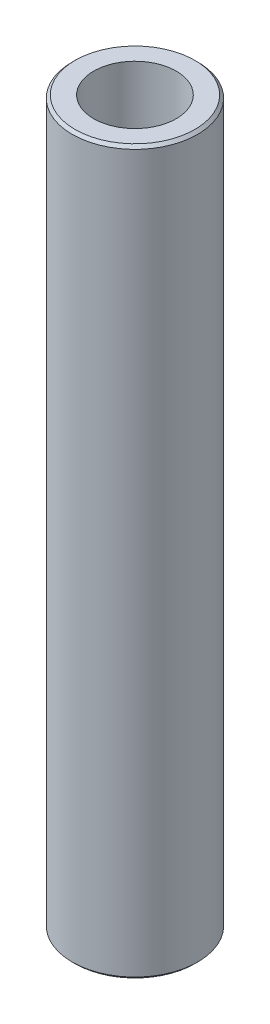
ISO-10303-21;
HEADER;
FILE_DESCRIPTION(('STEP AP214'),'2;1');
FILE_NAME('part.step','',(''),(''),'','','');
FILE_SCHEMA(('AUTOMOTIVE_DESIGN { 1 0 10303 214 1 1 1 1 }'));
ENDSEC;
DATA;
#1=APPLICATION_CONTEXT('core data for automotive mechanical design processes');
#2=APPLICATION_PROTOCOL_DEFINITION('international standard','automotive_design',2000,#1);
#3=PRODUCT_CONTEXT('',#1,'mechanical');
#4=PRODUCT('Part','Part','',(#3));
#5=PRODUCT_RELATED_PRODUCT_CATEGORY('part','',(#4));
#6=PRODUCT_DEFINITION_FORMATION('','',#4);
#7=PRODUCT_DEFINITION_CONTEXT('part definition',#1,'design');
#8=PRODUCT_DEFINITION('design','',#6,#7);
#9=PRODUCT_DEFINITION_SHAPE('','',#8);
#10=(LENGTH_UNIT() NAMED_UNIT(*) SI_UNIT(.MILLI.,.METRE.));
#11=(NAMED_UNIT(*) PLANE_ANGLE_UNIT() SI_UNIT($,.RADIAN.));
#12=(NAMED_UNIT(*) SI_UNIT($,.STERADIAN.) SOLID_ANGLE_UNIT());
#13=UNCERTAINTY_MEASURE_WITH_UNIT(LENGTH_MEASURE(1.E-05),#10,'distance_accuracy_value','');
#14=(GEOMETRIC_REPRESENTATION_CONTEXT(3) GLOBAL_UNCERTAINTY_ASSIGNED_CONTEXT((#13)) GLOBAL_UNIT_ASSIGNED_CONTEXT((#10,
#11,#12)) REPRESENTATION_CONTEXT('',''));
#15=CARTESIAN_POINT('',(0.,0.,0.));
#16=DIRECTION('',(0.,0.,1.));
#17=DIRECTION('',(1.,0.,0.));
#18=AXIS2_PLACEMENT_3D('',#15,#16,#17);
#19=CARTESIAN_POINT('',(0.,172.743536967441,0.));
#20=DIRECTION('',(0.,-1.,0.));
#21=DIRECTION('',(0.,0.,-1.));
#22=AXIS2_PLACEMENT_3D('',#19,#20,#21);
#23=CYLINDRICAL_SURFACE('',#22,15.);
#24=CARTESIAN_POINT('',(0.,172.067154813635,0.));
#25=DIRECTION('',(0.,1.,0.));
#26=DIRECTION('',(0.,0.,1.));
#27=AXIS2_PLACEMENT_3D('',#24,#25,#26);
#28=CIRCLE('',#27,15.);
#29=CARTESIAN_POINT('',(0.,172.067154813635,15.));
#30=VERTEX_POINT('',#29);
#31=EDGE_CURVE('E50',#30,#30,#28,.F.);
#32=ORIENTED_EDGE('',*,*,#31,.T.);
#33=EDGE_LOOP('',(#32));
#34=FACE_BOUND('',#33,.T.);
#35=CARTESIAN_POINT('',(0.,0.676382153805832,0.));
#36=DIRECTION('',(0.,1.,0.));
#37=DIRECTION('',(0.,0.,1.));
#38=AXIS2_PLACEMENT_3D('',#35,#36,#37);
#39=CIRCLE('',#38,15.);
#40=CARTESIAN_POINT('',(0.,0.676382153805832,15.));
#41=VERTEX_POINT('',#40);
#42=EDGE_CURVE('E51',#41,#41,#39,.T.);
#43=ORIENTED_EDGE('',*,*,#42,.T.);
#44=EDGE_LOOP('',(#43));
#45=FACE_BOUND('',#44,.T.);
#46=ADVANCED_FACE('F39',(#34,#45),#23,.T.);
#47=CARTESIAN_POINT('',(0.,172.743536967441,0.));
#48=DIRECTION('',(0.,1.,0.));
#49=DIRECTION('',(0.,0.,1.));
#50=AXIS2_PLACEMENT_3D('',#47,#48,#49);
#51=PLANE('',#50);
#52=CARTESIAN_POINT('',(0.,172.743536967441,0.));
#53=DIRECTION('',(0.,1.,0.));
#54=DIRECTION('',(0.,0.,1.));
#55=AXIS2_PLACEMENT_3D('',#52,#53,#54);
#56=CIRCLE('',#55,14.3236178461942);
#57=CARTESIAN_POINT('',(0.,172.743536967441,14.3236178461942));
#58=VERTEX_POINT('',#57);
#59=EDGE_CURVE('E54',#58,#58,#56,.T.);
#60=ORIENTED_EDGE('',*,*,#59,.T.);
#61=EDGE_LOOP('',(#60));
#62=FACE_BOUND('',#61,.T.);
#63=CARTESIAN_POINT('',(0.,172.743536967441,0.));
#64=DIRECTION('',(0.,1.,0.));
#65=DIRECTION('',(0.,0.,1.));
#66=AXIS2_PLACEMENT_3D('',#63,#64,#65);
#67=CIRCLE('',#66,9.87025809007072);
#68=CARTESIAN_POINT('',(0.,172.743536967441,9.87025809007072));
#69=VERTEX_POINT('',#68);
#70=EDGE_CURVE('E58',#69,#69,#67,.T.);
#71=ORIENTED_EDGE('',*,*,#70,.F.);
#72=EDGE_LOOP('',(#71));
#73=FACE_BOUND('',#72,.T.);
#74=ADVANCED_FACE('F69',(#62,#73),#51,.T.);
#75=CARTESIAN_POINT('',(0.,0.,0.));
#76=DIRECTION('',(0.,1.,0.));
#77=DIRECTION('',(0.,0.,1.));
#78=AXIS2_PLACEMENT_3D('',#75,#76,#77);
#79=PLANE('',#78);
#80=CARTESIAN_POINT('',(0.,0.,0.));
#81=DIRECTION('',(0.,1.,0.));
#82=DIRECTION('',(0.,0.,1.));
#83=AXIS2_PLACEMENT_3D('',#80,#81,#82);
#84=CIRCLE('',#83,14.3236178461942);
#85=CARTESIAN_POINT('',(0.,0.,14.3236178461942));
#86=VERTEX_POINT('',#85);
#87=EDGE_CURVE('E10',#86,#86,#84,.F.);
#88=ORIENTED_EDGE('',*,*,#87,.T.);
#89=EDGE_LOOP('',(#88));
#90=FACE_BOUND('',#89,.T.);
#91=CARTESIAN_POINT('',(0.,0.,0.));
#92=DIRECTION('',(0.,1.,0.));
#93=DIRECTION('',(0.,0.,1.));
#94=AXIS2_PLACEMENT_3D('',#91,#92,#93);
#95=CIRCLE('',#94,9.87025809007072);
#96=CARTESIAN_POINT('',(0.,0.,9.87025809007072));
#97=VERTEX_POINT('',#96);
#98=EDGE_CURVE('E63',#97,#97,#95,.T.);
#99=ORIENTED_EDGE('',*,*,#98,.T.);
#100=EDGE_LOOP('',(#99));
#101=FACE_BOUND('',#100,.T.);
#102=ADVANCED_FACE('F75',(#90,#101),#79,.F.);
#103=CARTESIAN_POINT('',(0.,172.743536967441,0.));
#104=DIRECTION('',(0.,-1.,0.));
#105=DIRECTION('',(0.,0.,-1.));
#106=AXIS2_PLACEMENT_3D('',#103,#104,#105);
#107=CYLINDRICAL_SURFACE('',#106,9.87025809007072);
#108=ORIENTED_EDGE('',*,*,#70,.T.);
#109=EDGE_LOOP('',(#108));
#110=FACE_BOUND('',#109,.T.);
#111=ORIENTED_EDGE('',*,*,#98,.F.);
#112=EDGE_LOOP('',(#111));
#113=FACE_BOUND('',#112,.T.);
#114=ADVANCED_FACE('F70',(#110,#113),#107,.F.);
#115=CARTESIAN_POINT('',(0.,172.743536967441,0.));
#116=DIRECTION('',(0.,-1.,0.));
#117=DIRECTION('',(0.,0.,-1.));
#118=AXIS2_PLACEMENT_3D('',#115,#116,#117);
#119=CONICAL_SURFACE('',#118,14.3236178461942,0.785398163397437);
#120=ORIENTED_EDGE('',*,*,#31,.F.);
#121=EDGE_LOOP('',(#120));
#122=FACE_BOUND('',#121,.T.);
#123=ORIENTED_EDGE('',*,*,#59,.F.);
#124=EDGE_LOOP('',(#123));
#125=FACE_BOUND('',#124,.T.);
#126=ADVANCED_FACE('F81',(#122,#125),#119,.T.);
#127=CARTESIAN_POINT('',(0.,0.676382153805832,0.));
#128=DIRECTION('',(0.,1.,0.));
#129=DIRECTION('',(0.,0.,1.));
#130=AXIS2_PLACEMENT_3D('',#127,#128,#129);
#131=CONICAL_SURFACE('',#130,15.,0.785398163397448);
#132=ORIENTED_EDGE('',*,*,#87,.F.);
#133=EDGE_LOOP('',(#132));
#134=FACE_BOUND('',#133,.T.);
#135=ORIENTED_EDGE('',*,*,#42,.F.);
#136=EDGE_LOOP('',(#135));
#137=FACE_BOUND('',#136,.T.);
#138=ADVANCED_FACE('F45',(#134,#137),#131,.T.);
#139=CLOSED_SHELL('',(#46,#74,#102,#114,#126,#138));
#140=MANIFOLD_SOLID_BREP('B2',#139);
#141=ADVANCED_BREP_SHAPE_REPRESENTATION('',(#18,#140),#14);
#142=SHAPE_DEFINITION_REPRESENTATION(#9,#141);
ENDSEC;
END-ISO-10303-21;
